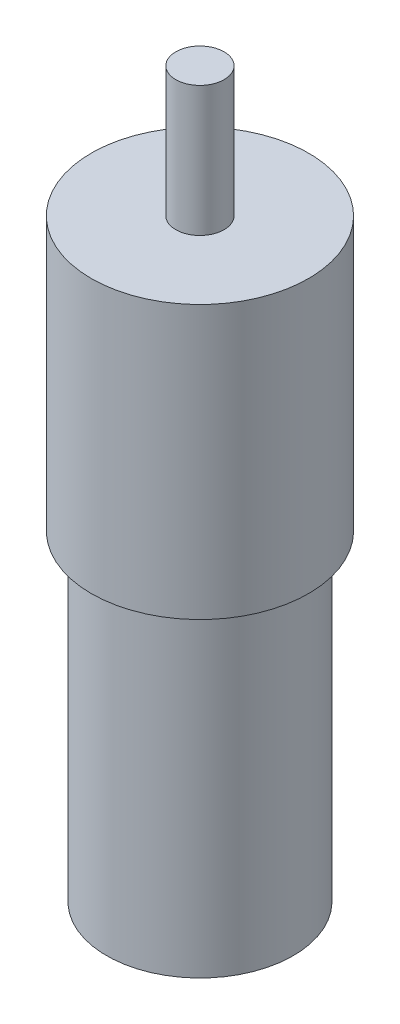
ISO-10303-21;
HEADER;
FILE_DESCRIPTION(('STEP AP214'),'2;1');
FILE_NAME('part.step','',(''),(''),'','','');
FILE_SCHEMA(('AUTOMOTIVE_DESIGN { 1 0 10303 214 1 1 1 1 }'));
ENDSEC;
DATA;
#1=APPLICATION_CONTEXT('core data for automotive mechanical design processes');
#2=APPLICATION_PROTOCOL_DEFINITION('international standard','automotive_design',2000,#1);
#3=PRODUCT_CONTEXT('',#1,'mechanical');
#4=PRODUCT('Part','Part','',(#3));
#5=PRODUCT_RELATED_PRODUCT_CATEGORY('part','',(#4));
#6=PRODUCT_DEFINITION_FORMATION('','',#4);
#7=PRODUCT_DEFINITION_CONTEXT('part definition',#1,'design');
#8=PRODUCT_DEFINITION('design','',#6,#7);
#9=PRODUCT_DEFINITION_SHAPE('','',#8);
#10=(LENGTH_UNIT() NAMED_UNIT(*) SI_UNIT(.MILLI.,.METRE.));
#11=(NAMED_UNIT(*) PLANE_ANGLE_UNIT() SI_UNIT($,.RADIAN.));
#12=(NAMED_UNIT(*) SI_UNIT($,.STERADIAN.) SOLID_ANGLE_UNIT());
#13=UNCERTAINTY_MEASURE_WITH_UNIT(LENGTH_MEASURE(1.E-05),#10,'distance_accuracy_value','');
#14=(GEOMETRIC_REPRESENTATION_CONTEXT(3) GLOBAL_UNCERTAINTY_ASSIGNED_CONTEXT((#13)) GLOBAL_UNIT_ASSIGNED_CONTEXT((#10,
#11,#12)) REPRESENTATION_CONTEXT('',''));
#15=CARTESIAN_POINT('',(0.,0.,0.));
#16=DIRECTION('',(0.,0.,1.));
#17=DIRECTION('',(1.,0.,0.));
#18=AXIS2_PLACEMENT_3D('',#15,#16,#17);
#19=CARTESIAN_POINT('',(0.,56.515,0.));
#20=DIRECTION('',(0.,-1.,0.));
#21=DIRECTION('',(0.,0.,-1.));
#22=AXIS2_PLACEMENT_3D('',#19,#20,#21);
#23=CYLINDRICAL_SURFACE('',#22,22.5044);
#24=CARTESIAN_POINT('',(0.,56.515,0.));
#25=DIRECTION('',(0.,1.,0.));
#26=DIRECTION('',(0.,0.,1.));
#27=AXIS2_PLACEMENT_3D('',#24,#25,#26);
#28=CIRCLE('',#27,22.5044);
#29=CARTESIAN_POINT('',(0.,56.515,22.5044));
#30=VERTEX_POINT('',#29);
#31=EDGE_CURVE('E43',#30,#30,#28,.T.);
#32=ORIENTED_EDGE('',*,*,#31,.F.);
#33=EDGE_LOOP('',(#32));
#34=FACE_BOUND('',#33,.T.);
#35=CARTESIAN_POINT('',(0.,0.,0.));
#36=DIRECTION('',(0.,1.,0.));
#37=DIRECTION('',(0.,0.,1.));
#38=AXIS2_PLACEMENT_3D('',#35,#36,#37);
#39=CIRCLE('',#38,22.5044);
#40=CARTESIAN_POINT('',(0.,0.,22.5044));
#41=VERTEX_POINT('',#40);
#42=EDGE_CURVE('E34',#41,#41,#39,.T.);
#43=ORIENTED_EDGE('',*,*,#42,.T.);
#44=EDGE_LOOP('',(#43));
#45=FACE_BOUND('',#44,.T.);
#46=ADVANCED_FACE('F31',(#34,#45),#23,.T.);
#47=CARTESIAN_POINT('',(0.,56.515,0.));
#48=DIRECTION('',(0.,1.,0.));
#49=DIRECTION('',(0.,0.,1.));
#50=AXIS2_PLACEMENT_3D('',#47,#48,#49);
#51=PLANE('',#50);
#52=CARTESIAN_POINT('',(0.,56.515,0.));
#53=DIRECTION('',(0.,1.,0.));
#54=DIRECTION('',(0.,0.,1.));
#55=AXIS2_PLACEMENT_3D('',#52,#53,#54);
#56=CIRCLE('',#55,4.99999);
#57=CARTESIAN_POINT('',(0.,56.515,4.99999));
#58=VERTEX_POINT('',#57);
#59=EDGE_CURVE('E38',#58,#58,#56,.T.);
#60=ORIENTED_EDGE('',*,*,#59,.F.);
#61=EDGE_LOOP('',(#60));
#62=FACE_BOUND('',#61,.T.);
#63=ORIENTED_EDGE('',*,*,#31,.T.);
#64=EDGE_LOOP('',(#63));
#65=FACE_BOUND('',#64,.T.);
#66=ADVANCED_FACE('F60',(#62,#65),#51,.T.);
#67=CARTESIAN_POINT('',(0.,0.,0.));
#68=DIRECTION('',(0.,1.,0.));
#69=DIRECTION('',(0.,0.,1.));
#70=AXIS2_PLACEMENT_3D('',#67,#68,#69);
#71=PLANE('',#70);
#72=CARTESIAN_POINT('',(0.,0.,0.));
#73=DIRECTION('',(0.,-1.,0.));
#74=DIRECTION('',(0.,0.,-1.));
#75=AXIS2_PLACEMENT_3D('',#72,#73,#74);
#76=CIRCLE('',#75,19.3294);
#77=CARTESIAN_POINT('',(0.,0.,-19.3294));
#78=VERTEX_POINT('',#77);
#79=EDGE_CURVE('E10',#78,#78,#76,.T.);
#80=ORIENTED_EDGE('',*,*,#79,.F.);
#81=EDGE_LOOP('',(#80));
#82=FACE_BOUND('',#81,.T.);
#83=ORIENTED_EDGE('',*,*,#42,.F.);
#84=EDGE_LOOP('',(#83));
#85=FACE_BOUND('',#84,.T.);
#86=ADVANCED_FACE('F57',(#82,#85),#71,.F.);
#87=CARTESIAN_POINT('',(0.,83.439,0.));
#88=DIRECTION('',(0.,-1.,0.));
#89=DIRECTION('',(0.,0.,-1.));
#90=AXIS2_PLACEMENT_3D('',#87,#88,#89);
#91=CYLINDRICAL_SURFACE('',#90,4.99999);
#92=CARTESIAN_POINT('',(0.,83.439,0.));
#93=DIRECTION('',(0.,1.,0.));
#94=DIRECTION('',(0.,0.,1.));
#95=AXIS2_PLACEMENT_3D('',#92,#93,#94);
#96=CIRCLE('',#95,4.99999);
#97=CARTESIAN_POINT('',(0.,83.439,4.99999));
#98=VERTEX_POINT('',#97);
#99=EDGE_CURVE('E48',#98,#98,#96,.T.);
#100=ORIENTED_EDGE('',*,*,#99,.F.);
#101=EDGE_LOOP('',(#100));
#102=FACE_BOUND('',#101,.T.);
#103=ORIENTED_EDGE('',*,*,#59,.T.);
#104=EDGE_LOOP('',(#103));
#105=FACE_BOUND('',#104,.T.);
#106=ADVANCED_FACE('F59',(#102,#105),#91,.T.);
#107=CARTESIAN_POINT('',(0.,83.439,0.));
#108=DIRECTION('',(0.,1.,0.));
#109=DIRECTION('',(0.,0.,1.));
#110=AXIS2_PLACEMENT_3D('',#107,#108,#109);
#111=PLANE('',#110);
#112=ORIENTED_EDGE('',*,*,#99,.T.);
#113=EDGE_LOOP('',(#112));
#114=FACE_BOUND('',#113,.T.);
#115=ADVANCED_FACE('F67',(#114),#111,.T.);
#116=CARTESIAN_POINT('',(0.,-66.548,0.));
#117=DIRECTION('',(0.,1.,0.));
#118=DIRECTION('',(0.,0.,1.));
#119=AXIS2_PLACEMENT_3D('',#116,#117,#118);
#120=CYLINDRICAL_SURFACE('',#119,19.3294);
#121=CARTESIAN_POINT('',(0.,-66.548,0.));
#122=DIRECTION('',(0.,-1.,0.));
#123=DIRECTION('',(0.,0.,-1.));
#124=AXIS2_PLACEMENT_3D('',#121,#122,#123);
#125=CIRCLE('',#124,19.3294);
#126=CARTESIAN_POINT('',(0.,-66.548,-19.3294));
#127=VERTEX_POINT('',#126);
#128=EDGE_CURVE('E47',#127,#127,#125,.T.);
#129=ORIENTED_EDGE('',*,*,#128,.F.);
#130=EDGE_LOOP('',(#129));
#131=FACE_BOUND('',#130,.T.);
#132=ORIENTED_EDGE('',*,*,#79,.T.);
#133=EDGE_LOOP('',(#132));
#134=FACE_BOUND('',#133,.T.);
#135=ADVANCED_FACE('F96',(#131,#134),#120,.T.);
#136=CARTESIAN_POINT('',(0.,-66.548,0.));
#137=DIRECTION('',(0.,-1.,0.));
#138=DIRECTION('',(0.,0.,-1.));
#139=AXIS2_PLACEMENT_3D('',#136,#137,#138);
#140=PLANE('',#139);
#141=ORIENTED_EDGE('',*,*,#128,.T.);
#142=EDGE_LOOP('',(#141));
#143=FACE_BOUND('',#142,.T.);
#144=ADVANCED_FACE('F103',(#143),#140,.T.);
#145=CLOSED_SHELL('',(#46,#66,#86,#106,#115,#135,#144));
#146=MANIFOLD_SOLID_BREP('B2',#145);
#147=ADVANCED_BREP_SHAPE_REPRESENTATION('',(#18,#146),#14);
#148=SHAPE_DEFINITION_REPRESENTATION(#9,#147);
ENDSEC;
END-ISO-10303-21;
